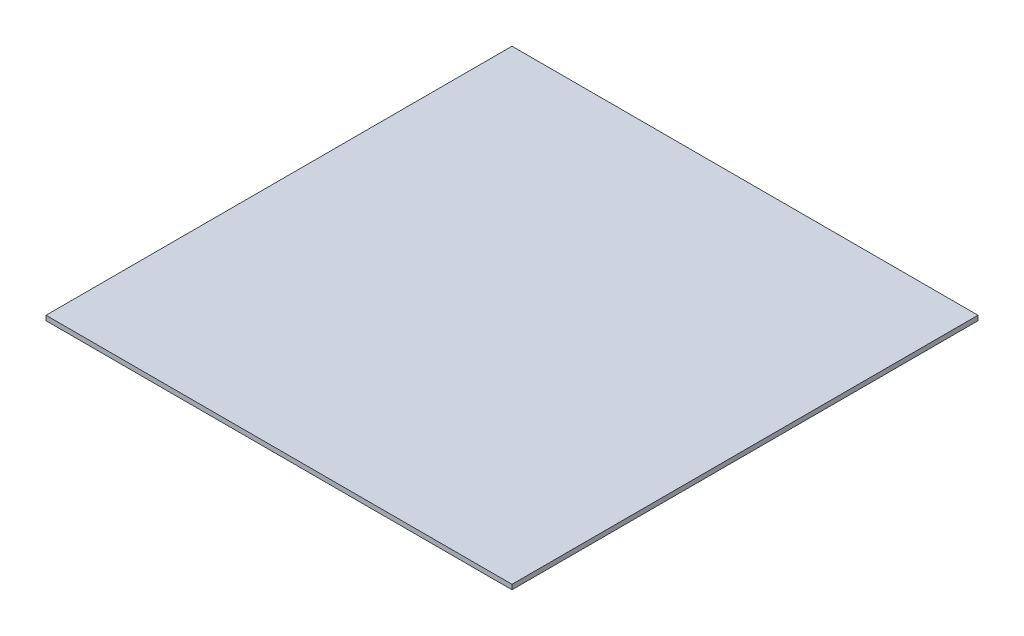
ISO-10303-21;
HEADER;
FILE_DESCRIPTION(('STEP AP214'),'2;1');
FILE_NAME('part.step','',(''),(''),'','','');
FILE_SCHEMA(('AUTOMOTIVE_DESIGN { 1 0 10303 214 1 1 1 1 }'));
ENDSEC;
DATA;
#1=APPLICATION_CONTEXT('core data for automotive mechanical design processes');
#2=APPLICATION_PROTOCOL_DEFINITION('international standard','automotive_design',2000,#1);
#3=PRODUCT_CONTEXT('',#1,'mechanical');
#4=PRODUCT('Part','Part','',(#3));
#5=PRODUCT_RELATED_PRODUCT_CATEGORY('part','',(#4));
#6=PRODUCT_DEFINITION_FORMATION('','',#4);
#7=PRODUCT_DEFINITION_CONTEXT('part definition',#1,'design');
#8=PRODUCT_DEFINITION('design','',#6,#7);
#9=PRODUCT_DEFINITION_SHAPE('','',#8);
#10=(LENGTH_UNIT() NAMED_UNIT(*) SI_UNIT(.MILLI.,.METRE.));
#11=(NAMED_UNIT(*) PLANE_ANGLE_UNIT() SI_UNIT($,.RADIAN.));
#12=(NAMED_UNIT(*) SI_UNIT($,.STERADIAN.) SOLID_ANGLE_UNIT());
#13=UNCERTAINTY_MEASURE_WITH_UNIT(LENGTH_MEASURE(1.E-05),#10,'distance_accuracy_value','');
#14=(GEOMETRIC_REPRESENTATION_CONTEXT(3) GLOBAL_UNCERTAINTY_ASSIGNED_CONTEXT((#13)) GLOBAL_UNIT_ASSIGNED_CONTEXT((#10,
#11,#12)) REPRESENTATION_CONTEXT('',''));
#15=CARTESIAN_POINT('',(0.,0.,0.));
#16=DIRECTION('',(0.,0.,1.));
#17=DIRECTION('',(1.,0.,0.));
#18=AXIS2_PLACEMENT_3D('',#15,#16,#17);
#19=CARTESIAN_POINT('',(-146.05,3.,146.05));
#20=DIRECTION('',(1.,0.,0.));
#21=DIRECTION('',(0.,0.,-1.));
#22=AXIS2_PLACEMENT_3D('',#19,#20,#21);
#23=PLANE('',#22);
#24=DIRECTION('',(0.,0.,1.));
#25=VECTOR('',#24,1.);
#26=CARTESIAN_POINT('',(-146.05,0.,146.05));
#27=LINE('',#26,#25);
#28=CARTESIAN_POINT('',(-146.05,0.,-146.05));
#29=VERTEX_POINT('',#28);
#30=CARTESIAN_POINT('',(-146.05,0.,146.05));
#31=VERTEX_POINT('',#30);
#32=EDGE_CURVE('E111',#29,#31,#27,.T.);
#33=ORIENTED_EDGE('',*,*,#32,.T.);
#34=DIRECTION('',(0.,-1.,0.));
#35=VECTOR('',#34,1.);
#36=CARTESIAN_POINT('',(-146.05,3.,146.05));
#37=LINE('',#36,#35);
#38=CARTESIAN_POINT('',(-146.05,3.,146.05));
#39=VERTEX_POINT('',#38);
#40=EDGE_CURVE('E11',#39,#31,#37,.T.);
#41=ORIENTED_EDGE('',*,*,#40,.F.);
#42=DIRECTION('',(0.,0.,1.));
#43=VECTOR('',#42,1.);
#44=CARTESIAN_POINT('',(-146.05,3.,146.05));
#45=LINE('',#44,#43);
#46=CARTESIAN_POINT('',(-146.05,3.,-146.05));
#47=VERTEX_POINT('',#46);
#48=EDGE_CURVE('E95',#47,#39,#45,.T.);
#49=ORIENTED_EDGE('',*,*,#48,.F.);
#50=DIRECTION('',(0.,-1.,0.));
#51=VECTOR('',#50,1.);
#52=CARTESIAN_POINT('',(-146.05,3.,-146.05));
#53=LINE('',#52,#51);
#54=EDGE_CURVE('E107',#47,#29,#53,.T.);
#55=ORIENTED_EDGE('',*,*,#54,.T.);
#56=EDGE_LOOP('',(#33,#41,#49,#55));
#57=FACE_BOUND('',#56,.T.);
#58=ADVANCED_FACE('F43',(#57),#23,.F.);
#59=CARTESIAN_POINT('',(146.05,3.,146.05));
#60=DIRECTION('',(0.,0.,-1.));
#61=DIRECTION('',(-1.,0.,0.));
#62=AXIS2_PLACEMENT_3D('',#59,#60,#61);
#63=PLANE('',#62);
#64=DIRECTION('',(1.,0.,0.));
#65=VECTOR('',#64,1.);
#66=CARTESIAN_POINT('',(146.05,0.,146.05));
#67=LINE('',#66,#65);
#68=CARTESIAN_POINT('',(146.05,0.,146.05));
#69=VERTEX_POINT('',#68);
#70=EDGE_CURVE('E100',#31,#69,#67,.T.);
#71=ORIENTED_EDGE('',*,*,#70,.T.);
#72=DIRECTION('',(0.,-1.,0.));
#73=VECTOR('',#72,1.);
#74=CARTESIAN_POINT('',(146.05,3.,146.05));
#75=LINE('',#74,#73);
#76=CARTESIAN_POINT('',(146.05,3.,146.05));
#77=VERTEX_POINT('',#76);
#78=EDGE_CURVE('E52',#77,#69,#75,.T.);
#79=ORIENTED_EDGE('',*,*,#78,.F.);
#80=DIRECTION('',(1.,0.,0.));
#81=VECTOR('',#80,1.);
#82=CARTESIAN_POINT('',(146.05,3.,146.05));
#83=LINE('',#82,#81);
#84=EDGE_CURVE('E90',#39,#77,#83,.T.);
#85=ORIENTED_EDGE('',*,*,#84,.F.);
#86=ORIENTED_EDGE('',*,*,#40,.T.);
#87=EDGE_LOOP('',(#71,#79,#85,#86));
#88=FACE_BOUND('',#87,.T.);
#89=ADVANCED_FACE('F99',(#88),#63,.F.);
#90=CARTESIAN_POINT('',(146.05,3.,146.05));
#91=DIRECTION('',(-1.,0.,0.));
#92=DIRECTION('',(0.,0.,1.));
#93=AXIS2_PLACEMENT_3D('',#90,#91,#92);
#94=PLANE('',#93);
#95=DIRECTION('',(0.,0.,-1.));
#96=VECTOR('',#95,1.);
#97=CARTESIAN_POINT('',(146.05,0.,146.05));
#98=LINE('',#97,#96);
#99=CARTESIAN_POINT('',(146.05,0.,-146.05));
#100=VERTEX_POINT('',#99);
#101=EDGE_CURVE('E77',#69,#100,#98,.T.);
#102=ORIENTED_EDGE('',*,*,#101,.T.);
#103=DIRECTION('',(0.,-1.,0.));
#104=VECTOR('',#103,1.);
#105=CARTESIAN_POINT('',(146.05,3.,-146.05));
#106=LINE('',#105,#104);
#107=CARTESIAN_POINT('',(146.05,3.,-146.05));
#108=VERTEX_POINT('',#107);
#109=EDGE_CURVE('E102',#108,#100,#106,.T.);
#110=ORIENTED_EDGE('',*,*,#109,.F.);
#111=DIRECTION('',(0.,0.,-1.));
#112=VECTOR('',#111,1.);
#113=CARTESIAN_POINT('',(146.05,3.,146.05));
#114=LINE('',#113,#112);
#115=EDGE_CURVE('E93',#77,#108,#114,.T.);
#116=ORIENTED_EDGE('',*,*,#115,.F.);
#117=ORIENTED_EDGE('',*,*,#78,.T.);
#118=EDGE_LOOP('',(#102,#110,#116,#117));
#119=FACE_BOUND('',#118,.T.);
#120=ADVANCED_FACE('F103',(#119),#94,.F.);
#121=CARTESIAN_POINT('',(146.05,3.,-146.05));
#122=DIRECTION('',(0.,0.,1.));
#123=DIRECTION('',(1.,0.,0.));
#124=AXIS2_PLACEMENT_3D('',#121,#122,#123);
#125=PLANE('',#124);
#126=DIRECTION('',(-1.,0.,0.));
#127=VECTOR('',#126,1.);
#128=CARTESIAN_POINT('',(146.05,0.,-146.05));
#129=LINE('',#128,#127);
#130=EDGE_CURVE('E83',#100,#29,#129,.T.);
#131=ORIENTED_EDGE('',*,*,#130,.T.);
#132=ORIENTED_EDGE('',*,*,#54,.F.);
#133=DIRECTION('',(-1.,0.,0.));
#134=VECTOR('',#133,1.);
#135=CARTESIAN_POINT('',(146.05,3.,-146.05));
#136=LINE('',#135,#134);
#137=EDGE_CURVE('E60',#108,#47,#136,.T.);
#138=ORIENTED_EDGE('',*,*,#137,.F.);
#139=ORIENTED_EDGE('',*,*,#109,.T.);
#140=EDGE_LOOP('',(#131,#132,#138,#139));
#141=FACE_BOUND('',#140,.T.);
#142=ADVANCED_FACE('F124',(#141),#125,.F.);
#143=CARTESIAN_POINT('',(0.,3.,0.));
#144=DIRECTION('',(0.,1.,0.));
#145=DIRECTION('',(0.,0.,1.));
#146=AXIS2_PLACEMENT_3D('',#143,#144,#145);
#147=PLANE('',#146);
#148=ORIENTED_EDGE('',*,*,#48,.T.);
#149=ORIENTED_EDGE('',*,*,#84,.T.);
#150=ORIENTED_EDGE('',*,*,#115,.T.);
#151=ORIENTED_EDGE('',*,*,#137,.T.);
#152=EDGE_LOOP('',(#148,#149,#150,#151));
#153=FACE_BOUND('',#152,.T.);
#154=ADVANCED_FACE('F91',(#153),#147,.T.);
#155=CARTESIAN_POINT('',(0.,0.,0.));
#156=DIRECTION('',(0.,1.,0.));
#157=DIRECTION('',(0.,0.,1.));
#158=AXIS2_PLACEMENT_3D('',#155,#156,#157);
#159=PLANE('',#158);
#160=ORIENTED_EDGE('',*,*,#32,.F.);
#161=ORIENTED_EDGE('',*,*,#130,.F.);
#162=ORIENTED_EDGE('',*,*,#101,.F.);
#163=ORIENTED_EDGE('',*,*,#70,.F.);
#164=EDGE_LOOP('',(#160,#161,#162,#163));
#165=FACE_BOUND('',#164,.T.);
#166=ADVANCED_FACE('F127',(#165),#159,.F.);
#167=CLOSED_SHELL('',(#58,#89,#120,#142,#154,#166));
#168=MANIFOLD_SOLID_BREP('B2',#167);
#169=ADVANCED_BREP_SHAPE_REPRESENTATION('',(#18,#168),#14);
#170=SHAPE_DEFINITION_REPRESENTATION(#9,#169);
ENDSEC;
END-ISO-10303-21;
